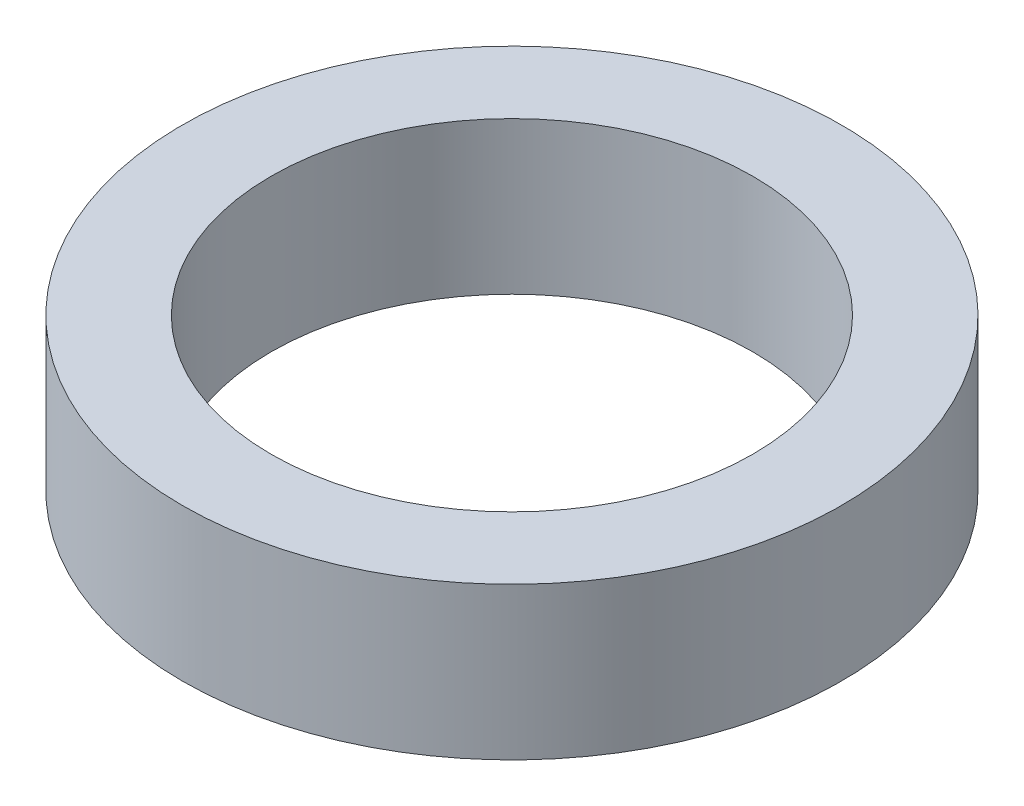
ISO-10303-21;
HEADER;
FILE_DESCRIPTION(('STEP AP214'),'2;1');
FILE_NAME('part.step','',(''),(''),'','','');
FILE_SCHEMA(('AUTOMOTIVE_DESIGN { 1 0 10303 214 1 1 1 1 }'));
ENDSEC;
DATA;
#1=APPLICATION_CONTEXT('core data for automotive mechanical design processes');
#2=APPLICATION_PROTOCOL_DEFINITION('international standard','automotive_design',2000,#1);
#3=PRODUCT_CONTEXT('',#1,'mechanical');
#4=PRODUCT('Part','Part','',(#3));
#5=PRODUCT_RELATED_PRODUCT_CATEGORY('part','',(#4));
#6=PRODUCT_DEFINITION_FORMATION('','',#4);
#7=PRODUCT_DEFINITION_CONTEXT('part definition',#1,'design');
#8=PRODUCT_DEFINITION('design','',#6,#7);
#9=PRODUCT_DEFINITION_SHAPE('','',#8);
#10=(LENGTH_UNIT() NAMED_UNIT(*) SI_UNIT(.MILLI.,.METRE.));
#11=(NAMED_UNIT(*) PLANE_ANGLE_UNIT() SI_UNIT($,.RADIAN.));
#12=(NAMED_UNIT(*) SI_UNIT($,.STERADIAN.) SOLID_ANGLE_UNIT());
#13=UNCERTAINTY_MEASURE_WITH_UNIT(LENGTH_MEASURE(1.E-05),#10,'distance_accuracy_value','');
#14=(GEOMETRIC_REPRESENTATION_CONTEXT(3) GLOBAL_UNCERTAINTY_ASSIGNED_CONTEXT((#13)) GLOBAL_UNIT_ASSIGNED_CONTEXT((#10,
#11,#12)) REPRESENTATION_CONTEXT('',''));
#15=CARTESIAN_POINT('',(0.,0.,0.));
#16=DIRECTION('',(0.,0.,1.));
#17=DIRECTION('',(1.,0.,0.));
#18=AXIS2_PLACEMENT_3D('',#15,#16,#17);
#19=CARTESIAN_POINT('',(0.,30.,0.));
#20=DIRECTION('',(0.,-1.,0.));
#21=DIRECTION('',(0.,0.,-1.));
#22=AXIS2_PLACEMENT_3D('',#19,#20,#21);
#23=CYLINDRICAL_SURFACE('',#22,65.);
#24=CARTESIAN_POINT('',(0.,30.,0.));
#25=DIRECTION('',(0.,1.,0.));
#26=DIRECTION('',(0.,0.,1.));
#27=AXIS2_PLACEMENT_3D('',#24,#25,#26);
#28=CIRCLE('',#27,65.);
#29=CARTESIAN_POINT('',(0.,30.,65.));
#30=VERTEX_POINT('',#29);
#31=EDGE_CURVE('E10',#30,#30,#28,.T.);
#32=ORIENTED_EDGE('',*,*,#31,.F.);
#33=EDGE_LOOP('',(#32));
#34=FACE_BOUND('',#33,.T.);
#35=CARTESIAN_POINT('',(0.,0.,0.));
#36=DIRECTION('',(0.,1.,0.));
#37=DIRECTION('',(0.,0.,1.));
#38=AXIS2_PLACEMENT_3D('',#35,#36,#37);
#39=CIRCLE('',#38,65.);
#40=CARTESIAN_POINT('',(0.,0.,65.));
#41=VERTEX_POINT('',#40);
#42=EDGE_CURVE('E37',#41,#41,#39,.T.);
#43=ORIENTED_EDGE('',*,*,#42,.T.);
#44=EDGE_LOOP('',(#43));
#45=FACE_BOUND('',#44,.T.);
#46=ADVANCED_FACE('F40',(#34,#45),#23,.T.);
#47=CARTESIAN_POINT('',(0.,30.,0.));
#48=DIRECTION('',(0.,1.,0.));
#49=DIRECTION('',(0.,0.,1.));
#50=AXIS2_PLACEMENT_3D('',#47,#48,#49);
#51=PLANE('',#50);
#52=CARTESIAN_POINT('',(0.,30.,0.));
#53=DIRECTION('',(0.,1.,0.));
#54=DIRECTION('',(0.,0.,1.));
#55=AXIS2_PLACEMENT_3D('',#52,#53,#54);
#56=CIRCLE('',#55,47.5);
#57=CARTESIAN_POINT('',(0.,30.,47.5));
#58=VERTEX_POINT('',#57);
#59=EDGE_CURVE('E50',#58,#58,#56,.T.);
#60=ORIENTED_EDGE('',*,*,#59,.F.);
#61=EDGE_LOOP('',(#60));
#62=FACE_BOUND('',#61,.T.);
#63=ORIENTED_EDGE('',*,*,#31,.T.);
#64=EDGE_LOOP('',(#63));
#65=FACE_BOUND('',#64,.T.);
#66=ADVANCED_FACE('F59',(#62,#65),#51,.T.);
#67=CARTESIAN_POINT('',(0.,0.,0.));
#68=DIRECTION('',(0.,1.,0.));
#69=DIRECTION('',(0.,0.,1.));
#70=AXIS2_PLACEMENT_3D('',#67,#68,#69);
#71=PLANE('',#70);
#72=CARTESIAN_POINT('',(0.,0.,0.));
#73=DIRECTION('',(0.,1.,0.));
#74=DIRECTION('',(0.,0.,1.));
#75=AXIS2_PLACEMENT_3D('',#72,#73,#74);
#76=CIRCLE('',#75,47.5);
#77=CARTESIAN_POINT('',(0.,0.,47.5));
#78=VERTEX_POINT('',#77);
#79=EDGE_CURVE('E47',#78,#78,#76,.T.);
#80=ORIENTED_EDGE('',*,*,#79,.T.);
#81=EDGE_LOOP('',(#80));
#82=FACE_BOUND('',#81,.T.);
#83=ORIENTED_EDGE('',*,*,#42,.F.);
#84=EDGE_LOOP('',(#83));
#85=FACE_BOUND('',#84,.T.);
#86=ADVANCED_FACE('F58',(#82,#85),#71,.F.);
#87=CARTESIAN_POINT('',(0.,30.,0.));
#88=DIRECTION('',(0.,-1.,0.));
#89=DIRECTION('',(0.,0.,-1.));
#90=AXIS2_PLACEMENT_3D('',#87,#88,#89);
#91=CYLINDRICAL_SURFACE('',#90,47.5);
#92=ORIENTED_EDGE('',*,*,#59,.T.);
#93=EDGE_LOOP('',(#92));
#94=FACE_BOUND('',#93,.T.);
#95=ORIENTED_EDGE('',*,*,#79,.F.);
#96=EDGE_LOOP('',(#95));
#97=FACE_BOUND('',#96,.T.);
#98=ADVANCED_FACE('F54',(#94,#97),#91,.F.);
#99=CLOSED_SHELL('',(#46,#66,#86,#98));
#100=MANIFOLD_SOLID_BREP('B2',#99);
#101=ADVANCED_BREP_SHAPE_REPRESENTATION('',(#18,#100),#14);
#102=SHAPE_DEFINITION_REPRESENTATION(#9,#101);
ENDSEC;
END-ISO-10303-21;
